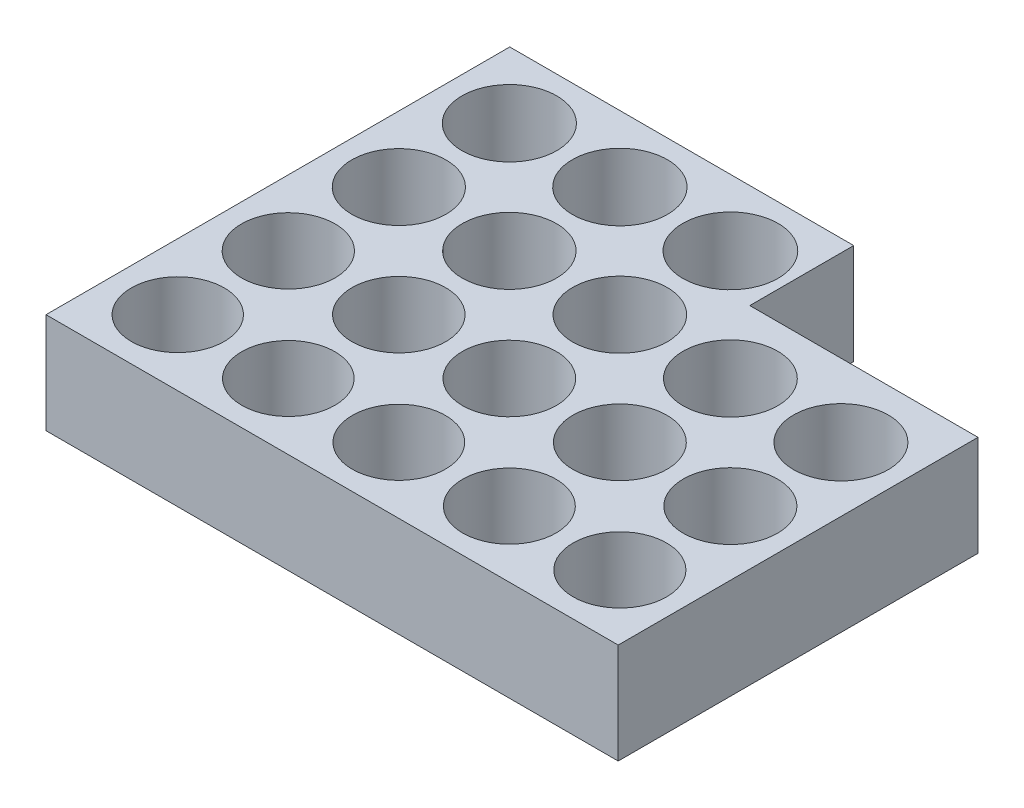
ISO-10303-21;
HEADER;
FILE_DESCRIPTION(('STEP AP214'),'2;1');
FILE_NAME('part.step','',(''),(''),'','','');
FILE_SCHEMA(('AUTOMOTIVE_DESIGN { 1 0 10303 214 1 1 1 1 }'));
ENDSEC;
DATA;
#1=APPLICATION_CONTEXT('core data for automotive mechanical design processes');
#2=APPLICATION_PROTOCOL_DEFINITION('international standard','automotive_design',2000,#1);
#3=PRODUCT_CONTEXT('',#1,'mechanical');
#4=PRODUCT('Part','Part','',(#3));
#5=PRODUCT_RELATED_PRODUCT_CATEGORY('part','',(#4));
#6=PRODUCT_DEFINITION_FORMATION('','',#4);
#7=PRODUCT_DEFINITION_CONTEXT('part definition',#1,'design');
#8=PRODUCT_DEFINITION('design','',#6,#7);
#9=PRODUCT_DEFINITION_SHAPE('','',#8);
#10=(LENGTH_UNIT() NAMED_UNIT(*) SI_UNIT(.MILLI.,.METRE.));
#11=(NAMED_UNIT(*) PLANE_ANGLE_UNIT() SI_UNIT($,.RADIAN.));
#12=(NAMED_UNIT(*) SI_UNIT($,.STERADIAN.) SOLID_ANGLE_UNIT());
#13=UNCERTAINTY_MEASURE_WITH_UNIT(LENGTH_MEASURE(1.E-05),#10,'distance_accuracy_value','');
#14=(GEOMETRIC_REPRESENTATION_CONTEXT(3) GLOBAL_UNCERTAINTY_ASSIGNED_CONTEXT((#13)) GLOBAL_UNIT_ASSIGNED_CONTEXT((#10,
#11,#12)) REPRESENTATION_CONTEXT('',''));
#15=CARTESIAN_POINT('',(0.,0.,0.));
#16=DIRECTION('',(0.,0.,1.));
#17=DIRECTION('',(1.,0.,0.));
#18=AXIS2_PLACEMENT_3D('',#15,#16,#17);
#19=CARTESIAN_POINT('',(0.,7.62,0.));
#20=DIRECTION('',(0.,-1.,0.));
#21=DIRECTION('',(0.,0.,-1.));
#22=AXIS2_PLACEMENT_3D('',#19,#20,#21);
#23=PLANE('',#22);
#24=DIRECTION('',(0.,0.,1.));
#25=VECTOR('',#24,1.);
#26=CARTESIAN_POINT('',(0.,7.62,0.));
#27=LINE('',#26,#25);
#28=CARTESIAN_POINT('',(0.,7.62,-35.171413764314));
#29=VERTEX_POINT('',#28);
#30=CARTESIAN_POINT('',(0.,7.62,0.));
#31=VERTEX_POINT('',#30);
#32=EDGE_CURVE('E132',#29,#31,#27,.T.);
#33=ORIENTED_EDGE('',*,*,#32,.T.);
#34=DIRECTION('',(1.,0.,0.));
#35=VECTOR('',#34,1.);
#36=CARTESIAN_POINT('',(0.,7.62,0.));
#37=LINE('',#36,#35);
#38=CARTESIAN_POINT('',(43.3961522069588,7.62,0.));
#39=VERTEX_POINT('',#38);
#40=EDGE_CURVE('E90',#31,#39,#37,.T.);
#41=ORIENTED_EDGE('',*,*,#40,.T.);
#42=DIRECTION('',(0.,0.,-1.));
#43=VECTOR('',#42,1.);
#44=CARTESIAN_POINT('',(43.3961522069588,7.62,0.));
#45=LINE('',#44,#43);
#46=CARTESIAN_POINT('',(43.3961522069588,7.62,-27.2882373873568));
#47=VERTEX_POINT('',#46);
#48=EDGE_CURVE('E103',#39,#47,#45,.T.);
#49=ORIENTED_EDGE('',*,*,#48,.T.);
#50=DIRECTION('',(-1.,0.,0.));
#51=VECTOR('',#50,1.);
#52=CARTESIAN_POINT('',(26.0886949522203,7.62,-27.2882373873568));
#53=LINE('',#52,#51);
#54=CARTESIAN_POINT('',(26.0886949522203,7.62,-27.2882373873568));
#55=VERTEX_POINT('',#54);
#56=EDGE_CURVE('E97',#47,#55,#53,.T.);
#57=ORIENTED_EDGE('',*,*,#56,.T.);
#58=DIRECTION('',(0.,0.,-1.));
#59=VECTOR('',#58,1.);
#60=CARTESIAN_POINT('',(26.0886949522203,7.62,-35.171413764314));
#61=LINE('',#60,#59);
#62=CARTESIAN_POINT('',(26.0886949522203,7.62,-35.171413764314));
#63=VERTEX_POINT('',#62);
#64=EDGE_CURVE('E101',#55,#63,#61,.T.);
#65=ORIENTED_EDGE('',*,*,#64,.T.);
#66=DIRECTION('',(-1.,0.,0.));
#67=VECTOR('',#66,1.);
#68=CARTESIAN_POINT('',(0.,7.62,-35.171413764314));
#69=LINE('',#68,#67);
#70=EDGE_CURVE('E53',#63,#29,#69,.T.);
#71=ORIENTED_EDGE('',*,*,#70,.T.);
#72=EDGE_LOOP('',(#33,#41,#49,#57,#65,#71));
#73=FACE_BOUND('',#72,.T.);
#74=CARTESIAN_POINT('',(4.99744585881437,7.62,-4.99744585881437));
#75=DIRECTION('',(0.,1.,0.));
#76=DIRECTION('',(0.,0.,1.));
#77=AXIS2_PLACEMENT_3D('',#74,#75,#76);
#78=CIRCLE('',#77,3.525);
#79=CARTESIAN_POINT('',(4.99744585881437,7.62,-1.47244585881437));
#80=VERTEX_POINT('',#79);
#81=EDGE_CURVE('E125',#80,#80,#78,.T.);
#82=ORIENTED_EDGE('',*,*,#81,.F.);
#83=EDGE_LOOP('',(#82));
#84=FACE_BOUND('',#83,.T.);
#85=CARTESIAN_POINT('',(13.3794458588144,7.62,-4.99744585881437));
#86=DIRECTION('',(0.,1.,0.));
#87=DIRECTION('',(0.,0.,1.));
#88=AXIS2_PLACEMENT_3D('',#85,#86,#87);
#89=CIRCLE('',#88,3.53);
#90=CARTESIAN_POINT('',(13.3794458588144,7.62,-1.46744585881437));
#91=VERTEX_POINT('',#90);
#92=EDGE_CURVE('E336',#91,#91,#89,.T.);
#93=ORIENTED_EDGE('',*,*,#92,.F.);
#94=EDGE_LOOP('',(#93));
#95=FACE_BOUND('',#94,.T.);
#96=CARTESIAN_POINT('',(21.7614458588144,7.62,-4.99744585881437));
#97=DIRECTION('',(0.,1.,0.));
#98=DIRECTION('',(0.,0.,1.));
#99=AXIS2_PLACEMENT_3D('',#96,#97,#98);
#100=CIRCLE('',#99,3.535);
#101=CARTESIAN_POINT('',(21.7614458588144,7.62,-1.46244585881437));
#102=VERTEX_POINT('',#101);
#103=EDGE_CURVE('E330',#102,#102,#100,.T.);
#104=ORIENTED_EDGE('',*,*,#103,.F.);
#105=EDGE_LOOP('',(#104));
#106=FACE_BOUND('',#105,.T.);
#107=CARTESIAN_POINT('',(30.1434458588144,7.62,-4.99744585881437));
#108=DIRECTION('',(0.,1.,0.));
#109=DIRECTION('',(0.,0.,1.));
#110=AXIS2_PLACEMENT_3D('',#107,#108,#109);
#111=CIRCLE('',#110,3.54);
#112=CARTESIAN_POINT('',(30.1434458588144,7.62,-1.45744585881437));
#113=VERTEX_POINT('',#112);
#114=EDGE_CURVE('E324',#113,#113,#111,.T.);
#115=ORIENTED_EDGE('',*,*,#114,.F.);
#116=EDGE_LOOP('',(#115));
#117=FACE_BOUND('',#116,.T.);
#118=CARTESIAN_POINT('',(38.5254458588144,7.62,-4.99744585881437));
#119=DIRECTION('',(0.,1.,0.));
#120=DIRECTION('',(0.,0.,1.));
#121=AXIS2_PLACEMENT_3D('',#118,#119,#120);
#122=CIRCLE('',#121,3.545);
#123=CARTESIAN_POINT('',(38.5254458588144,7.62,-1.45244585881437));
#124=VERTEX_POINT('',#123);
#125=EDGE_CURVE('E318',#124,#124,#122,.T.);
#126=ORIENTED_EDGE('',*,*,#125,.F.);
#127=EDGE_LOOP('',(#126));
#128=FACE_BOUND('',#127,.T.);
#129=CARTESIAN_POINT('',(13.3794458588144,7.62,-13.3794458588144));
#130=DIRECTION('',(0.,1.,0.));
#131=DIRECTION('',(0.,0.,1.));
#132=AXIS2_PLACEMENT_3D('',#129,#130,#131);
#133=CIRCLE('',#132,3.555);
#134=CARTESIAN_POINT('',(13.3794458588144,7.62,-9.82444585881437));
#135=VERTEX_POINT('',#134);
#136=EDGE_CURVE('E312',#135,#135,#133,.T.);
#137=ORIENTED_EDGE('',*,*,#136,.F.);
#138=EDGE_LOOP('',(#137));
#139=FACE_BOUND('',#138,.T.);
#140=CARTESIAN_POINT('',(21.7614458588144,7.62,-13.3794458588144));
#141=DIRECTION('',(0.,1.,0.));
#142=DIRECTION('',(0.,0.,1.));
#143=AXIS2_PLACEMENT_3D('',#140,#141,#142);
#144=CIRCLE('',#143,3.56);
#145=CARTESIAN_POINT('',(21.7614458588144,7.62,-9.81944585881437));
#146=VERTEX_POINT('',#145);
#147=EDGE_CURVE('E306',#146,#146,#144,.T.);
#148=ORIENTED_EDGE('',*,*,#147,.F.);
#149=EDGE_LOOP('',(#148));
#150=FACE_BOUND('',#149,.T.);
#151=CARTESIAN_POINT('',(30.1434458588144,7.62,-13.3794458588144));
#152=DIRECTION('',(0.,1.,0.));
#153=DIRECTION('',(0.,0.,1.));
#154=AXIS2_PLACEMENT_3D('',#151,#152,#153);
#155=CIRCLE('',#154,3.565);
#156=CARTESIAN_POINT('',(30.1434458588144,7.62,-9.81444585881437));
#157=VERTEX_POINT('',#156);
#158=EDGE_CURVE('E300',#157,#157,#155,.T.);
#159=ORIENTED_EDGE('',*,*,#158,.F.);
#160=EDGE_LOOP('',(#159));
#161=FACE_BOUND('',#160,.T.);
#162=CARTESIAN_POINT('',(38.5254458588144,7.62,-13.3794458588144));
#163=DIRECTION('',(0.,1.,0.));
#164=DIRECTION('',(0.,0.,1.));
#165=AXIS2_PLACEMENT_3D('',#162,#163,#164);
#166=CIRCLE('',#165,3.57);
#167=CARTESIAN_POINT('',(38.5254458588144,7.62,-9.80944585881437));
#168=VERTEX_POINT('',#167);
#169=EDGE_CURVE('E294',#168,#168,#166,.T.);
#170=ORIENTED_EDGE('',*,*,#169,.F.);
#171=EDGE_LOOP('',(#170));
#172=FACE_BOUND('',#171,.T.);
#173=CARTESIAN_POINT('',(13.3794458588144,7.62,-21.7614458588144));
#174=DIRECTION('',(0.,1.,0.));
#175=DIRECTION('',(0.,0.,1.));
#176=AXIS2_PLACEMENT_3D('',#173,#174,#175);
#177=CIRCLE('',#176,3.58000000000001);
#178=CARTESIAN_POINT('',(13.3794458588144,7.62,-18.1814458588144));
#179=VERTEX_POINT('',#178);
#180=EDGE_CURVE('E288',#179,#179,#177,.T.);
#181=ORIENTED_EDGE('',*,*,#180,.F.);
#182=EDGE_LOOP('',(#181));
#183=FACE_BOUND('',#182,.T.);
#184=CARTESIAN_POINT('',(21.7614458588144,7.62,-21.7614458588144));
#185=DIRECTION('',(0.,1.,0.));
#186=DIRECTION('',(0.,0.,1.));
#187=AXIS2_PLACEMENT_3D('',#184,#185,#186);
#188=CIRCLE('',#187,3.585);
#189=CARTESIAN_POINT('',(21.7614458588144,7.62,-18.1764458588144));
#190=VERTEX_POINT('',#189);
#191=EDGE_CURVE('E282',#190,#190,#188,.T.);
#192=ORIENTED_EDGE('',*,*,#191,.F.);
#193=EDGE_LOOP('',(#192));
#194=FACE_BOUND('',#193,.T.);
#195=CARTESIAN_POINT('',(30.1434458588144,7.62,-21.7614458588144));
#196=DIRECTION('',(0.,1.,0.));
#197=DIRECTION('',(0.,0.,1.));
#198=AXIS2_PLACEMENT_3D('',#195,#196,#197);
#199=CIRCLE('',#198,3.59);
#200=CARTESIAN_POINT('',(30.1434458588144,7.62,-18.1714458588144));
#201=VERTEX_POINT('',#200);
#202=EDGE_CURVE('E276',#201,#201,#199,.T.);
#203=ORIENTED_EDGE('',*,*,#202,.F.);
#204=EDGE_LOOP('',(#203));
#205=FACE_BOUND('',#204,.T.);
#206=CARTESIAN_POINT('',(38.5254458588144,7.62,-21.7614458588144));
#207=DIRECTION('',(0.,1.,0.));
#208=DIRECTION('',(0.,0.,1.));
#209=AXIS2_PLACEMENT_3D('',#206,#207,#208);
#210=CIRCLE('',#209,3.595);
#211=CARTESIAN_POINT('',(38.5254458588144,7.62,-18.1664458588144));
#212=VERTEX_POINT('',#211);
#213=EDGE_CURVE('E270',#212,#212,#210,.T.);
#214=ORIENTED_EDGE('',*,*,#213,.F.);
#215=EDGE_LOOP('',(#214));
#216=FACE_BOUND('',#215,.T.);
#217=CARTESIAN_POINT('',(13.3794458588144,7.62,-30.1434458588144));
#218=DIRECTION('',(0.,1.,0.));
#219=DIRECTION('',(0.,0.,1.));
#220=AXIS2_PLACEMENT_3D('',#217,#218,#219);
#221=CIRCLE('',#220,3.60499999999999);
#222=CARTESIAN_POINT('',(13.3794458588144,7.62,-26.5384458588144));
#223=VERTEX_POINT('',#222);
#224=EDGE_CURVE('E264',#223,#223,#221,.T.);
#225=ORIENTED_EDGE('',*,*,#224,.F.);
#226=EDGE_LOOP('',(#225));
#227=FACE_BOUND('',#226,.T.);
#228=CARTESIAN_POINT('',(21.7614458588144,7.62,-30.1434458588144));
#229=DIRECTION('',(0.,1.,0.));
#230=DIRECTION('',(0.,0.,1.));
#231=AXIS2_PLACEMENT_3D('',#228,#229,#230);
#232=CIRCLE('',#231,3.615);
#233=CARTESIAN_POINT('',(21.7614458588144,7.62,-26.5284458588144));
#234=VERTEX_POINT('',#233);
#235=EDGE_CURVE('E258',#234,#234,#232,.T.);
#236=ORIENTED_EDGE('',*,*,#235,.F.);
#237=EDGE_LOOP('',(#236));
#238=FACE_BOUND('',#237,.T.);
#239=CARTESIAN_POINT('',(4.99744585881434,7.62,-13.3794458588144));
#240=DIRECTION('',(0.,1.,0.));
#241=DIRECTION('',(0.,0.,1.));
#242=AXIS2_PLACEMENT_3D('',#239,#240,#241);
#243=CIRCLE('',#242,3.55);
#244=CARTESIAN_POINT('',(4.99744585881434,7.62,-9.82944585881437));
#245=VERTEX_POINT('',#244);
#246=EDGE_CURVE('E252',#245,#245,#243,.T.);
#247=ORIENTED_EDGE('',*,*,#246,.F.);
#248=EDGE_LOOP('',(#247));
#249=FACE_BOUND('',#248,.T.);
#250=CARTESIAN_POINT('',(4.99744585881436,7.62,-21.7614458588144));
#251=DIRECTION('',(0.,1.,0.));
#252=DIRECTION('',(0.,0.,1.));
#253=AXIS2_PLACEMENT_3D('',#250,#251,#252);
#254=CIRCLE('',#253,3.575);
#255=CARTESIAN_POINT('',(4.99744585881436,7.62,-18.1864458588144));
#256=VERTEX_POINT('',#255);
#257=EDGE_CURVE('E246',#256,#256,#254,.T.);
#258=ORIENTED_EDGE('',*,*,#257,.F.);
#259=EDGE_LOOP('',(#258));
#260=FACE_BOUND('',#259,.T.);
#261=CARTESIAN_POINT('',(4.99744585881436,7.62,-30.1434458588144));
#262=DIRECTION('',(0.,1.,0.));
#263=DIRECTION('',(0.,0.,1.));
#264=AXIS2_PLACEMENT_3D('',#261,#262,#263);
#265=CIRCLE('',#264,3.6);
#266=CARTESIAN_POINT('',(4.99744585881436,7.62,-26.5434458588144));
#267=VERTEX_POINT('',#266);
#268=EDGE_CURVE('E237',#267,#267,#265,.T.);
#269=ORIENTED_EDGE('',*,*,#268,.F.);
#270=EDGE_LOOP('',(#269));
#271=FACE_BOUND('',#270,.T.);
#272=ADVANCED_FACE('F36',(#73,#84,#95,#106,#117,#128,#139,#150,#161,#172,#183,#194,#205,#216,
#227,#238,#249,#260,#271),#23,.F.);
#273=CARTESIAN_POINT('',(0.,0.,0.));
#274=DIRECTION('',(0.,-1.,0.));
#275=DIRECTION('',(0.,0.,-1.));
#276=AXIS2_PLACEMENT_3D('',#273,#274,#275);
#277=PLANE('',#276);
#278=CARTESIAN_POINT('',(4.99744585881436,0.,-21.7614458588144));
#279=DIRECTION('',(0.,1.,0.));
#280=DIRECTION('',(0.,0.,1.));
#281=AXIS2_PLACEMENT_3D('',#278,#279,#280);
#282=CIRCLE('',#281,3.575);
#283=CARTESIAN_POINT('',(4.99744585881436,0.,-18.1864458588144));
#284=VERTEX_POINT('',#283);
#285=EDGE_CURVE('E243',#284,#284,#282,.T.);
#286=ORIENTED_EDGE('',*,*,#285,.T.);
#287=EDGE_LOOP('',(#286));
#288=FACE_BOUND('',#287,.T.);
#289=CARTESIAN_POINT('',(21.7614458588144,0.,-30.1434458588144));
#290=DIRECTION('',(0.,1.,0.));
#291=DIRECTION('',(0.,0.,1.));
#292=AXIS2_PLACEMENT_3D('',#289,#290,#291);
#293=CIRCLE('',#292,3.615);
#294=CARTESIAN_POINT('',(21.7614458588144,0.,-26.5284458588144));
#295=VERTEX_POINT('',#294);
#296=EDGE_CURVE('E255',#295,#295,#293,.T.);
#297=ORIENTED_EDGE('',*,*,#296,.T.);
#298=EDGE_LOOP('',(#297));
#299=FACE_BOUND('',#298,.T.);
#300=CARTESIAN_POINT('',(38.5254458588144,0.,-21.7614458588144));
#301=DIRECTION('',(0.,1.,0.));
#302=DIRECTION('',(0.,0.,1.));
#303=AXIS2_PLACEMENT_3D('',#300,#301,#302);
#304=CIRCLE('',#303,3.595);
#305=CARTESIAN_POINT('',(38.5254458588144,0.,-18.1664458588144));
#306=VERTEX_POINT('',#305);
#307=EDGE_CURVE('E267',#306,#306,#304,.T.);
#308=ORIENTED_EDGE('',*,*,#307,.T.);
#309=EDGE_LOOP('',(#308));
#310=FACE_BOUND('',#309,.T.);
#311=CARTESIAN_POINT('',(21.7614458588144,0.,-21.7614458588144));
#312=DIRECTION('',(0.,1.,0.));
#313=DIRECTION('',(0.,0.,1.));
#314=AXIS2_PLACEMENT_3D('',#311,#312,#313);
#315=CIRCLE('',#314,3.585);
#316=CARTESIAN_POINT('',(21.7614458588144,0.,-18.1764458588144));
#317=VERTEX_POINT('',#316);
#318=EDGE_CURVE('E279',#317,#317,#315,.T.);
#319=ORIENTED_EDGE('',*,*,#318,.T.);
#320=EDGE_LOOP('',(#319));
#321=FACE_BOUND('',#320,.T.);
#322=CARTESIAN_POINT('',(38.5254458588144,0.,-13.3794458588144));
#323=DIRECTION('',(0.,1.,0.));
#324=DIRECTION('',(0.,0.,1.));
#325=AXIS2_PLACEMENT_3D('',#322,#323,#324);
#326=CIRCLE('',#325,3.57);
#327=CARTESIAN_POINT('',(38.5254458588144,0.,-9.80944585881437));
#328=VERTEX_POINT('',#327);
#329=EDGE_CURVE('E291',#328,#328,#326,.T.);
#330=ORIENTED_EDGE('',*,*,#329,.T.);
#331=EDGE_LOOP('',(#330));
#332=FACE_BOUND('',#331,.T.);
#333=CARTESIAN_POINT('',(21.7614458588144,0.,-13.3794458588144));
#334=DIRECTION('',(0.,1.,0.));
#335=DIRECTION('',(0.,0.,1.));
#336=AXIS2_PLACEMENT_3D('',#333,#334,#335);
#337=CIRCLE('',#336,3.56);
#338=CARTESIAN_POINT('',(21.7614458588144,0.,-9.81944585881437));
#339=VERTEX_POINT('',#338);
#340=EDGE_CURVE('E303',#339,#339,#337,.T.);
#341=ORIENTED_EDGE('',*,*,#340,.T.);
#342=EDGE_LOOP('',(#341));
#343=FACE_BOUND('',#342,.T.);
#344=CARTESIAN_POINT('',(38.5254458588144,0.,-4.99744585881437));
#345=DIRECTION('',(0.,1.,0.));
#346=DIRECTION('',(0.,0.,1.));
#347=AXIS2_PLACEMENT_3D('',#344,#345,#346);
#348=CIRCLE('',#347,3.545);
#349=CARTESIAN_POINT('',(38.5254458588144,0.,-1.45244585881437));
#350=VERTEX_POINT('',#349);
#351=EDGE_CURVE('E315',#350,#350,#348,.T.);
#352=ORIENTED_EDGE('',*,*,#351,.T.);
#353=EDGE_LOOP('',(#352));
#354=FACE_BOUND('',#353,.T.);
#355=CARTESIAN_POINT('',(21.7614458588144,0.,-4.99744585881437));
#356=DIRECTION('',(0.,1.,0.));
#357=DIRECTION('',(0.,0.,1.));
#358=AXIS2_PLACEMENT_3D('',#355,#356,#357);
#359=CIRCLE('',#358,3.535);
#360=CARTESIAN_POINT('',(21.7614458588144,0.,-1.46244585881437));
#361=VERTEX_POINT('',#360);
#362=EDGE_CURVE('E327',#361,#361,#359,.T.);
#363=ORIENTED_EDGE('',*,*,#362,.T.);
#364=EDGE_LOOP('',(#363));
#365=FACE_BOUND('',#364,.T.);
#366=CARTESIAN_POINT('',(4.99744585881437,0.,-4.99744585881437));
#367=DIRECTION('',(0.,1.,0.));
#368=DIRECTION('',(0.,0.,1.));
#369=AXIS2_PLACEMENT_3D('',#366,#367,#368);
#370=CIRCLE('',#369,3.525);
#371=CARTESIAN_POINT('',(4.99744585881437,0.,-1.47244585881437));
#372=VERTEX_POINT('',#371);
#373=EDGE_CURVE('E339',#372,#372,#370,.T.);
#374=ORIENTED_EDGE('',*,*,#373,.T.);
#375=EDGE_LOOP('',(#374));
#376=FACE_BOUND('',#375,.T.);
#377=DIRECTION('',(0.,0.,1.));
#378=VECTOR('',#377,1.);
#379=CARTESIAN_POINT('',(0.,0.,0.));
#380=LINE('',#379,#378);
#381=CARTESIAN_POINT('',(0.,0.,-35.171413764314));
#382=VERTEX_POINT('',#381);
#383=CARTESIAN_POINT('',(0.,0.,0.));
#384=VERTEX_POINT('',#383);
#385=EDGE_CURVE('E121',#382,#384,#380,.T.);
#386=ORIENTED_EDGE('',*,*,#385,.F.);
#387=DIRECTION('',(-1.,0.,0.));
#388=VECTOR('',#387,1.);
#389=CARTESIAN_POINT('',(0.,0.,-35.171413764314));
#390=LINE('',#389,#388);
#391=CARTESIAN_POINT('',(26.0886949522203,0.,-35.171413764314));
#392=VERTEX_POINT('',#391);
#393=EDGE_CURVE('E82',#392,#382,#390,.T.);
#394=ORIENTED_EDGE('',*,*,#393,.F.);
#395=DIRECTION('',(0.,0.,-1.));
#396=VECTOR('',#395,1.);
#397=CARTESIAN_POINT('',(26.0886949522203,0.,-35.171413764314));
#398=LINE('',#397,#396);
#399=CARTESIAN_POINT('',(26.0886949522203,0.,-27.2882373873568));
#400=VERTEX_POINT('',#399);
#401=EDGE_CURVE('E76',#400,#392,#398,.T.);
#402=ORIENTED_EDGE('',*,*,#401,.F.);
#403=DIRECTION('',(-1.,0.,0.));
#404=VECTOR('',#403,1.);
#405=CARTESIAN_POINT('',(26.0886949522203,0.,-27.2882373873568));
#406=LINE('',#405,#404);
#407=CARTESIAN_POINT('',(43.3961522069588,0.,-27.2882373873568));
#408=VERTEX_POINT('',#407);
#409=EDGE_CURVE('E111',#408,#400,#406,.T.);
#410=ORIENTED_EDGE('',*,*,#409,.F.);
#411=DIRECTION('',(0.,0.,-1.));
#412=VECTOR('',#411,1.);
#413=CARTESIAN_POINT('',(43.3961522069588,0.,0.));
#414=LINE('',#413,#412);
#415=CARTESIAN_POINT('',(43.3961522069588,0.,0.));
#416=VERTEX_POINT('',#415);
#417=EDGE_CURVE('E127',#416,#408,#414,.T.);
#418=ORIENTED_EDGE('',*,*,#417,.F.);
#419=DIRECTION('',(1.,0.,0.));
#420=VECTOR('',#419,1.);
#421=CARTESIAN_POINT('',(0.,0.,0.));
#422=LINE('',#421,#420);
#423=EDGE_CURVE('E124',#384,#416,#422,.T.);
#424=ORIENTED_EDGE('',*,*,#423,.F.);
#425=EDGE_LOOP('',(#386,#394,#402,#410,#418,#424));
#426=FACE_BOUND('',#425,.T.);
#427=CARTESIAN_POINT('',(13.3794458588144,0.,-4.99744585881437));
#428=DIRECTION('',(0.,1.,0.));
#429=DIRECTION('',(0.,0.,1.));
#430=AXIS2_PLACEMENT_3D('',#427,#428,#429);
#431=CIRCLE('',#430,3.53);
#432=CARTESIAN_POINT('',(13.3794458588144,0.,-1.46744585881437));
#433=VERTEX_POINT('',#432);
#434=EDGE_CURVE('E333',#433,#433,#431,.T.);
#435=ORIENTED_EDGE('',*,*,#434,.T.);
#436=EDGE_LOOP('',(#435));
#437=FACE_BOUND('',#436,.T.);
#438=CARTESIAN_POINT('',(30.1434458588144,0.,-4.99744585881437));
#439=DIRECTION('',(0.,1.,0.));
#440=DIRECTION('',(0.,0.,1.));
#441=AXIS2_PLACEMENT_3D('',#438,#439,#440);
#442=CIRCLE('',#441,3.54);
#443=CARTESIAN_POINT('',(30.1434458588144,0.,-1.45744585881437));
#444=VERTEX_POINT('',#443);
#445=EDGE_CURVE('E321',#444,#444,#442,.T.);
#446=ORIENTED_EDGE('',*,*,#445,.T.);
#447=EDGE_LOOP('',(#446));
#448=FACE_BOUND('',#447,.T.);
#449=CARTESIAN_POINT('',(13.3794458588144,0.,-13.3794458588144));
#450=DIRECTION('',(0.,1.,0.));
#451=DIRECTION('',(0.,0.,1.));
#452=AXIS2_PLACEMENT_3D('',#449,#450,#451);
#453=CIRCLE('',#452,3.555);
#454=CARTESIAN_POINT('',(13.3794458588144,0.,-9.82444585881437));
#455=VERTEX_POINT('',#454);
#456=EDGE_CURVE('E309',#455,#455,#453,.T.);
#457=ORIENTED_EDGE('',*,*,#456,.T.);
#458=EDGE_LOOP('',(#457));
#459=FACE_BOUND('',#458,.T.);
#460=CARTESIAN_POINT('',(30.1434458588144,0.,-13.3794458588144));
#461=DIRECTION('',(0.,1.,0.));
#462=DIRECTION('',(0.,0.,1.));
#463=AXIS2_PLACEMENT_3D('',#460,#461,#462);
#464=CIRCLE('',#463,3.565);
#465=CARTESIAN_POINT('',(30.1434458588144,0.,-9.81444585881437));
#466=VERTEX_POINT('',#465);
#467=EDGE_CURVE('E297',#466,#466,#464,.T.);
#468=ORIENTED_EDGE('',*,*,#467,.T.);
#469=EDGE_LOOP('',(#468));
#470=FACE_BOUND('',#469,.T.);
#471=CARTESIAN_POINT('',(13.3794458588144,0.,-21.7614458588144));
#472=DIRECTION('',(0.,1.,0.));
#473=DIRECTION('',(0.,0.,1.));
#474=AXIS2_PLACEMENT_3D('',#471,#472,#473);
#475=CIRCLE('',#474,3.58000000000001);
#476=CARTESIAN_POINT('',(13.3794458588144,0.,-18.1814458588144));
#477=VERTEX_POINT('',#476);
#478=EDGE_CURVE('E285',#477,#477,#475,.T.);
#479=ORIENTED_EDGE('',*,*,#478,.T.);
#480=EDGE_LOOP('',(#479));
#481=FACE_BOUND('',#480,.T.);
#482=CARTESIAN_POINT('',(30.1434458588144,0.,-21.7614458588144));
#483=DIRECTION('',(0.,1.,0.));
#484=DIRECTION('',(0.,0.,1.));
#485=AXIS2_PLACEMENT_3D('',#482,#483,#484);
#486=CIRCLE('',#485,3.59);
#487=CARTESIAN_POINT('',(30.1434458588144,0.,-18.1714458588144));
#488=VERTEX_POINT('',#487);
#489=EDGE_CURVE('E273',#488,#488,#486,.T.);
#490=ORIENTED_EDGE('',*,*,#489,.T.);
#491=EDGE_LOOP('',(#490));
#492=FACE_BOUND('',#491,.T.);
#493=CARTESIAN_POINT('',(13.3794458588144,0.,-30.1434458588144));
#494=DIRECTION('',(0.,1.,0.));
#495=DIRECTION('',(0.,0.,1.));
#496=AXIS2_PLACEMENT_3D('',#493,#494,#495);
#497=CIRCLE('',#496,3.60499999999999);
#498=CARTESIAN_POINT('',(13.3794458588144,0.,-26.5384458588144));
#499=VERTEX_POINT('',#498);
#500=EDGE_CURVE('E261',#499,#499,#497,.T.);
#501=ORIENTED_EDGE('',*,*,#500,.T.);
#502=EDGE_LOOP('',(#501));
#503=FACE_BOUND('',#502,.T.);
#504=CARTESIAN_POINT('',(4.99744585881434,0.,-13.3794458588144));
#505=DIRECTION('',(0.,1.,0.));
#506=DIRECTION('',(0.,0.,1.));
#507=AXIS2_PLACEMENT_3D('',#504,#505,#506);
#508=CIRCLE('',#507,3.55);
#509=CARTESIAN_POINT('',(4.99744585881434,0.,-9.82944585881437));
#510=VERTEX_POINT('',#509);
#511=EDGE_CURVE('E249',#510,#510,#508,.T.);
#512=ORIENTED_EDGE('',*,*,#511,.T.);
#513=EDGE_LOOP('',(#512));
#514=FACE_BOUND('',#513,.T.);
#515=CARTESIAN_POINT('',(4.99744585881436,0.,-30.1434458588144));
#516=DIRECTION('',(0.,1.,0.));
#517=DIRECTION('',(0.,0.,1.));
#518=AXIS2_PLACEMENT_3D('',#515,#516,#517);
#519=CIRCLE('',#518,3.6);
#520=CARTESIAN_POINT('',(4.99744585881436,0.,-26.5434458588144));
#521=VERTEX_POINT('',#520);
#522=EDGE_CURVE('E240',#521,#521,#519,.T.);
#523=ORIENTED_EDGE('',*,*,#522,.T.);
#524=EDGE_LOOP('',(#523));
#525=FACE_BOUND('',#524,.T.);
#526=ADVANCED_FACE('F141',(#288,#299,#310,#321,#332,#343,#354,#365,#376,#426,#437,#448,#459,
#470,#481,#492,#503,#514,#525),#277,.T.);
#527=CARTESIAN_POINT('',(0.,7.62,0.));
#528=DIRECTION('',(1.,0.,0.));
#529=DIRECTION('',(0.,0.,-1.));
#530=AXIS2_PLACEMENT_3D('',#527,#528,#529);
#531=PLANE('',#530);
#532=ORIENTED_EDGE('',*,*,#385,.T.);
#533=DIRECTION('',(0.,-1.,0.));
#534=VECTOR('',#533,1.);
#535=CARTESIAN_POINT('',(0.,7.62,0.));
#536=LINE('',#535,#534);
#537=EDGE_CURVE('E11',#31,#384,#536,.T.);
#538=ORIENTED_EDGE('',*,*,#537,.F.);
#539=ORIENTED_EDGE('',*,*,#32,.F.);
#540=DIRECTION('',(0.,-1.,0.));
#541=VECTOR('',#540,1.);
#542=CARTESIAN_POINT('',(0.,7.62,-35.171413764314));
#543=LINE('',#542,#541);
#544=EDGE_CURVE('E117',#29,#382,#543,.T.);
#545=ORIENTED_EDGE('',*,*,#544,.T.);
#546=EDGE_LOOP('',(#532,#538,#539,#545));
#547=FACE_BOUND('',#546,.T.);
#548=ADVANCED_FACE('F38',(#547),#531,.F.);
#549=CARTESIAN_POINT('',(0.,7.62,0.));
#550=DIRECTION('',(0.,0.,-1.));
#551=DIRECTION('',(-1.,0.,0.));
#552=AXIS2_PLACEMENT_3D('',#549,#550,#551);
#553=PLANE('',#552);
#554=ORIENTED_EDGE('',*,*,#423,.T.);
#555=DIRECTION('',(0.,-1.,0.));
#556=VECTOR('',#555,1.);
#557=CARTESIAN_POINT('',(43.3961522069588,7.62,0.));
#558=LINE('',#557,#556);
#559=EDGE_CURVE('E45',#39,#416,#558,.T.);
#560=ORIENTED_EDGE('',*,*,#559,.F.);
#561=ORIENTED_EDGE('',*,*,#40,.F.);
#562=ORIENTED_EDGE('',*,*,#537,.T.);
#563=EDGE_LOOP('',(#554,#560,#561,#562));
#564=FACE_BOUND('',#563,.T.);
#565=ADVANCED_FACE('F525',(#564),#553,.F.);
#566=CARTESIAN_POINT('',(43.3961522069588,7.62,0.));
#567=DIRECTION('',(-1.,0.,0.));
#568=DIRECTION('',(0.,0.,1.));
#569=AXIS2_PLACEMENT_3D('',#566,#567,#568);
#570=PLANE('',#569);
#571=ORIENTED_EDGE('',*,*,#417,.T.);
#572=DIRECTION('',(0.,-1.,0.));
#573=VECTOR('',#572,1.);
#574=CARTESIAN_POINT('',(43.3961522069588,7.62,-27.2882373873568));
#575=LINE('',#574,#573);
#576=EDGE_CURVE('E112',#47,#408,#575,.T.);
#577=ORIENTED_EDGE('',*,*,#576,.F.);
#578=ORIENTED_EDGE('',*,*,#48,.F.);
#579=ORIENTED_EDGE('',*,*,#559,.T.);
#580=EDGE_LOOP('',(#571,#577,#578,#579));
#581=FACE_BOUND('',#580,.T.);
#582=ADVANCED_FACE('F138',(#581),#570,.F.);
#583=CARTESIAN_POINT('',(26.0886949522203,7.62,-27.2882373873568));
#584=DIRECTION('',(0.,0.,1.));
#585=DIRECTION('',(1.,0.,0.));
#586=AXIS2_PLACEMENT_3D('',#583,#584,#585);
#587=PLANE('',#586);
#588=ORIENTED_EDGE('',*,*,#409,.T.);
#589=DIRECTION('',(0.,-1.,0.));
#590=VECTOR('',#589,1.);
#591=CARTESIAN_POINT('',(26.0886949522203,7.62,-27.2882373873568));
#592=LINE('',#591,#590);
#593=EDGE_CURVE('E108',#55,#400,#592,.T.);
#594=ORIENTED_EDGE('',*,*,#593,.F.);
#595=ORIENTED_EDGE('',*,*,#56,.F.);
#596=ORIENTED_EDGE('',*,*,#576,.T.);
#597=EDGE_LOOP('',(#588,#594,#595,#596));
#598=FACE_BOUND('',#597,.T.);
#599=ADVANCED_FACE('F109',(#598),#587,.F.);
#600=CARTESIAN_POINT('',(26.0886949522203,7.62,-35.171413764314));
#601=DIRECTION('',(-1.,0.,0.));
#602=DIRECTION('',(0.,0.,1.));
#603=AXIS2_PLACEMENT_3D('',#600,#601,#602);
#604=PLANE('',#603);
#605=ORIENTED_EDGE('',*,*,#401,.T.);
#606=DIRECTION('',(0.,-1.,0.));
#607=VECTOR('',#606,1.);
#608=CARTESIAN_POINT('',(26.0886949522203,7.62,-35.171413764314));
#609=LINE('',#608,#607);
#610=EDGE_CURVE('E113',#63,#392,#609,.T.);
#611=ORIENTED_EDGE('',*,*,#610,.F.);
#612=ORIENTED_EDGE('',*,*,#64,.F.);
#613=ORIENTED_EDGE('',*,*,#593,.T.);
#614=EDGE_LOOP('',(#605,#611,#612,#613));
#615=FACE_BOUND('',#614,.T.);
#616=ADVANCED_FACE('F115',(#615),#604,.F.);
#617=CARTESIAN_POINT('',(0.,7.62,-35.171413764314));
#618=DIRECTION('',(0.,0.,1.));
#619=DIRECTION('',(1.,0.,0.));
#620=AXIS2_PLACEMENT_3D('',#617,#618,#619);
#621=PLANE('',#620);
#622=ORIENTED_EDGE('',*,*,#393,.T.);
#623=ORIENTED_EDGE('',*,*,#544,.F.);
#624=ORIENTED_EDGE('',*,*,#70,.F.);
#625=ORIENTED_EDGE('',*,*,#610,.T.);
#626=EDGE_LOOP('',(#622,#623,#624,#625));
#627=FACE_BOUND('',#626,.T.);
#628=ADVANCED_FACE('F146',(#627),#621,.F.);
#629=CARTESIAN_POINT('',(4.99744585881437,7.62,-4.99744585881437));
#630=DIRECTION('',(0.,-1.,0.));
#631=DIRECTION('',(0.,0.,-1.));
#632=AXIS2_PLACEMENT_3D('',#629,#630,#631);
#633=CYLINDRICAL_SURFACE('',#632,3.525);
#634=ORIENTED_EDGE('',*,*,#81,.T.);
#635=EDGE_LOOP('',(#634));
#636=FACE_BOUND('',#635,.T.);
#637=ORIENTED_EDGE('',*,*,#373,.F.);
#638=EDGE_LOOP('',(#637));
#639=FACE_BOUND('',#638,.T.);
#640=ADVANCED_FACE('F148',(#636,#639),#633,.F.);
#641=CARTESIAN_POINT('',(13.3794458588144,7.62,-4.99744585881437));
#642=DIRECTION('',(0.,-1.,0.));
#643=DIRECTION('',(0.,0.,-1.));
#644=AXIS2_PLACEMENT_3D('',#641,#642,#643);
#645=CYLINDRICAL_SURFACE('',#644,3.53);
#646=ORIENTED_EDGE('',*,*,#92,.T.);
#647=EDGE_LOOP('',(#646));
#648=FACE_BOUND('',#647,.T.);
#649=ORIENTED_EDGE('',*,*,#434,.F.);
#650=EDGE_LOOP('',(#649));
#651=FACE_BOUND('',#650,.T.);
#652=ADVANCED_FACE('F154',(#648,#651),#645,.F.);
#653=CARTESIAN_POINT('',(21.7614458588144,7.62,-4.99744585881437));
#654=DIRECTION('',(0.,-1.,0.));
#655=DIRECTION('',(0.,0.,-1.));
#656=AXIS2_PLACEMENT_3D('',#653,#654,#655);
#657=CYLINDRICAL_SURFACE('',#656,3.535);
#658=ORIENTED_EDGE('',*,*,#103,.T.);
#659=EDGE_LOOP('',(#658));
#660=FACE_BOUND('',#659,.T.);
#661=ORIENTED_EDGE('',*,*,#362,.F.);
#662=EDGE_LOOP('',(#661));
#663=FACE_BOUND('',#662,.T.);
#664=ADVANCED_FACE('F168',(#660,#663),#657,.F.);
#665=CARTESIAN_POINT('',(30.1434458588144,7.62,-4.99744585881437));
#666=DIRECTION('',(0.,-1.,0.));
#667=DIRECTION('',(0.,0.,-1.));
#668=AXIS2_PLACEMENT_3D('',#665,#666,#667);
#669=CYLINDRICAL_SURFACE('',#668,3.54);
#670=ORIENTED_EDGE('',*,*,#114,.T.);
#671=EDGE_LOOP('',(#670));
#672=FACE_BOUND('',#671,.T.);
#673=ORIENTED_EDGE('',*,*,#445,.F.);
#674=EDGE_LOOP('',(#673));
#675=FACE_BOUND('',#674,.T.);
#676=ADVANCED_FACE('F172',(#672,#675),#669,.F.);
#677=CARTESIAN_POINT('',(38.5254458588144,7.62,-4.99744585881437));
#678=DIRECTION('',(0.,-1.,0.));
#679=DIRECTION('',(0.,0.,-1.));
#680=AXIS2_PLACEMENT_3D('',#677,#678,#679);
#681=CYLINDRICAL_SURFACE('',#680,3.545);
#682=ORIENTED_EDGE('',*,*,#125,.T.);
#683=EDGE_LOOP('',(#682));
#684=FACE_BOUND('',#683,.T.);
#685=ORIENTED_EDGE('',*,*,#351,.F.);
#686=EDGE_LOOP('',(#685));
#687=FACE_BOUND('',#686,.T.);
#688=ADVANCED_FACE('F176',(#684,#687),#681,.F.);
#689=CARTESIAN_POINT('',(13.3794458588144,7.62,-13.3794458588144));
#690=DIRECTION('',(0.,-1.,0.));
#691=DIRECTION('',(0.,0.,-1.));
#692=AXIS2_PLACEMENT_3D('',#689,#690,#691);
#693=CYLINDRICAL_SURFACE('',#692,3.555);
#694=ORIENTED_EDGE('',*,*,#136,.T.);
#695=EDGE_LOOP('',(#694));
#696=FACE_BOUND('',#695,.T.);
#697=ORIENTED_EDGE('',*,*,#456,.F.);
#698=EDGE_LOOP('',(#697));
#699=FACE_BOUND('',#698,.T.);
#700=ADVANCED_FACE('F180',(#696,#699),#693,.F.);
#701=CARTESIAN_POINT('',(21.7614458588144,7.62,-13.3794458588144));
#702=DIRECTION('',(0.,-1.,0.));
#703=DIRECTION('',(0.,0.,-1.));
#704=AXIS2_PLACEMENT_3D('',#701,#702,#703);
#705=CYLINDRICAL_SURFACE('',#704,3.56);
#706=ORIENTED_EDGE('',*,*,#147,.T.);
#707=EDGE_LOOP('',(#706));
#708=FACE_BOUND('',#707,.T.);
#709=ORIENTED_EDGE('',*,*,#340,.F.);
#710=EDGE_LOOP('',(#709));
#711=FACE_BOUND('',#710,.T.);
#712=ADVANCED_FACE('F184',(#708,#711),#705,.F.);
#713=CARTESIAN_POINT('',(30.1434458588144,7.62,-13.3794458588144));
#714=DIRECTION('',(0.,-1.,0.));
#715=DIRECTION('',(0.,0.,-1.));
#716=AXIS2_PLACEMENT_3D('',#713,#714,#715);
#717=CYLINDRICAL_SURFACE('',#716,3.565);
#718=ORIENTED_EDGE('',*,*,#158,.T.);
#719=EDGE_LOOP('',(#718));
#720=FACE_BOUND('',#719,.T.);
#721=ORIENTED_EDGE('',*,*,#467,.F.);
#722=EDGE_LOOP('',(#721));
#723=FACE_BOUND('',#722,.T.);
#724=ADVANCED_FACE('F188',(#720,#723),#717,.F.);
#725=CARTESIAN_POINT('',(38.5254458588144,7.62,-13.3794458588144));
#726=DIRECTION('',(0.,-1.,0.));
#727=DIRECTION('',(0.,0.,-1.));
#728=AXIS2_PLACEMENT_3D('',#725,#726,#727);
#729=CYLINDRICAL_SURFACE('',#728,3.57);
#730=ORIENTED_EDGE('',*,*,#169,.T.);
#731=EDGE_LOOP('',(#730));
#732=FACE_BOUND('',#731,.T.);
#733=ORIENTED_EDGE('',*,*,#329,.F.);
#734=EDGE_LOOP('',(#733));
#735=FACE_BOUND('',#734,.T.);
#736=ADVANCED_FACE('F192',(#732,#735),#729,.F.);
#737=CARTESIAN_POINT('',(13.3794458588144,7.62,-21.7614458588144));
#738=DIRECTION('',(0.,-1.,0.));
#739=DIRECTION('',(0.,0.,-1.));
#740=AXIS2_PLACEMENT_3D('',#737,#738,#739);
#741=CYLINDRICAL_SURFACE('',#740,3.58000000000001);
#742=ORIENTED_EDGE('',*,*,#180,.T.);
#743=EDGE_LOOP('',(#742));
#744=FACE_BOUND('',#743,.T.);
#745=ORIENTED_EDGE('',*,*,#478,.F.);
#746=EDGE_LOOP('',(#745));
#747=FACE_BOUND('',#746,.T.);
#748=ADVANCED_FACE('F196',(#744,#747),#741,.F.);
#749=CARTESIAN_POINT('',(21.7614458588144,7.62,-21.7614458588144));
#750=DIRECTION('',(0.,-1.,0.));
#751=DIRECTION('',(0.,0.,-1.));
#752=AXIS2_PLACEMENT_3D('',#749,#750,#751);
#753=CYLINDRICAL_SURFACE('',#752,3.585);
#754=ORIENTED_EDGE('',*,*,#191,.T.);
#755=EDGE_LOOP('',(#754));
#756=FACE_BOUND('',#755,.T.);
#757=ORIENTED_EDGE('',*,*,#318,.F.);
#758=EDGE_LOOP('',(#757));
#759=FACE_BOUND('',#758,.T.);
#760=ADVANCED_FACE('F200',(#756,#759),#753,.F.);
#761=CARTESIAN_POINT('',(30.1434458588144,7.62,-21.7614458588144));
#762=DIRECTION('',(0.,-1.,0.));
#763=DIRECTION('',(0.,0.,-1.));
#764=AXIS2_PLACEMENT_3D('',#761,#762,#763);
#765=CYLINDRICAL_SURFACE('',#764,3.59);
#766=ORIENTED_EDGE('',*,*,#202,.T.);
#767=EDGE_LOOP('',(#766));
#768=FACE_BOUND('',#767,.T.);
#769=ORIENTED_EDGE('',*,*,#489,.F.);
#770=EDGE_LOOP('',(#769));
#771=FACE_BOUND('',#770,.T.);
#772=ADVANCED_FACE('F204',(#768,#771),#765,.F.);
#773=CARTESIAN_POINT('',(38.5254458588144,7.62,-21.7614458588144));
#774=DIRECTION('',(0.,-1.,0.));
#775=DIRECTION('',(0.,0.,-1.));
#776=AXIS2_PLACEMENT_3D('',#773,#774,#775);
#777=CYLINDRICAL_SURFACE('',#776,3.595);
#778=ORIENTED_EDGE('',*,*,#213,.T.);
#779=EDGE_LOOP('',(#778));
#780=FACE_BOUND('',#779,.T.);
#781=ORIENTED_EDGE('',*,*,#307,.F.);
#782=EDGE_LOOP('',(#781));
#783=FACE_BOUND('',#782,.T.);
#784=ADVANCED_FACE('F208',(#780,#783),#777,.F.);
#785=CARTESIAN_POINT('',(13.3794458588144,7.62,-30.1434458588144));
#786=DIRECTION('',(0.,-1.,0.));
#787=DIRECTION('',(0.,0.,-1.));
#788=AXIS2_PLACEMENT_3D('',#785,#786,#787);
#789=CYLINDRICAL_SURFACE('',#788,3.60499999999999);
#790=ORIENTED_EDGE('',*,*,#224,.T.);
#791=EDGE_LOOP('',(#790));
#792=FACE_BOUND('',#791,.T.);
#793=ORIENTED_EDGE('',*,*,#500,.F.);
#794=EDGE_LOOP('',(#793));
#795=FACE_BOUND('',#794,.T.);
#796=ADVANCED_FACE('F212',(#792,#795),#789,.F.);
#797=CARTESIAN_POINT('',(21.7614458588144,7.62,-30.1434458588144));
#798=DIRECTION('',(0.,-1.,0.));
#799=DIRECTION('',(0.,0.,-1.));
#800=AXIS2_PLACEMENT_3D('',#797,#798,#799);
#801=CYLINDRICAL_SURFACE('',#800,3.615);
#802=ORIENTED_EDGE('',*,*,#235,.T.);
#803=EDGE_LOOP('',(#802));
#804=FACE_BOUND('',#803,.T.);
#805=ORIENTED_EDGE('',*,*,#296,.F.);
#806=EDGE_LOOP('',(#805));
#807=FACE_BOUND('',#806,.T.);
#808=ADVANCED_FACE('F216',(#804,#807),#801,.F.);
#809=CARTESIAN_POINT('',(4.99744585881434,7.62,-13.3794458588144));
#810=DIRECTION('',(0.,-1.,0.));
#811=DIRECTION('',(0.,0.,-1.));
#812=AXIS2_PLACEMENT_3D('',#809,#810,#811);
#813=CYLINDRICAL_SURFACE('',#812,3.55);
#814=ORIENTED_EDGE('',*,*,#246,.T.);
#815=EDGE_LOOP('',(#814));
#816=FACE_BOUND('',#815,.T.);
#817=ORIENTED_EDGE('',*,*,#511,.F.);
#818=EDGE_LOOP('',(#817));
#819=FACE_BOUND('',#818,.T.);
#820=ADVANCED_FACE('F220',(#816,#819),#813,.F.);
#821=CARTESIAN_POINT('',(4.99744585881436,7.62,-21.7614458588144));
#822=DIRECTION('',(0.,-1.,0.));
#823=DIRECTION('',(0.,0.,-1.));
#824=AXIS2_PLACEMENT_3D('',#821,#822,#823);
#825=CYLINDRICAL_SURFACE('',#824,3.575);
#826=ORIENTED_EDGE('',*,*,#257,.T.);
#827=EDGE_LOOP('',(#826));
#828=FACE_BOUND('',#827,.T.);
#829=ORIENTED_EDGE('',*,*,#285,.F.);
#830=EDGE_LOOP('',(#829));
#831=FACE_BOUND('',#830,.T.);
#832=ADVANCED_FACE('F224',(#828,#831),#825,.F.);
#833=CARTESIAN_POINT('',(4.99744585881436,7.62,-30.1434458588144));
#834=DIRECTION('',(0.,-1.,0.));
#835=DIRECTION('',(0.,0.,-1.));
#836=AXIS2_PLACEMENT_3D('',#833,#834,#835);
#837=CYLINDRICAL_SURFACE('',#836,3.6);
#838=ORIENTED_EDGE('',*,*,#268,.T.);
#839=EDGE_LOOP('',(#838));
#840=FACE_BOUND('',#839,.T.);
#841=ORIENTED_EDGE('',*,*,#522,.F.);
#842=EDGE_LOOP('',(#841));
#843=FACE_BOUND('',#842,.T.);
#844=ADVANCED_FACE('F228',(#840,#843),#837,.F.);
#845=CLOSED_SHELL('',(#272,#526,#548,#565,#582,#599,#616,#628,#640,#652,#664,#676,#688,#700,
#712,#724,#736,#748,#760,#772,#784,#796,#808,#820,#832,#844));
#846=MANIFOLD_SOLID_BREP('B2',#845);
#847=ADVANCED_BREP_SHAPE_REPRESENTATION('',(#18,#846),#14);
#848=SHAPE_DEFINITION_REPRESENTATION(#9,#847);
ENDSEC;
END-ISO-10303-21;
